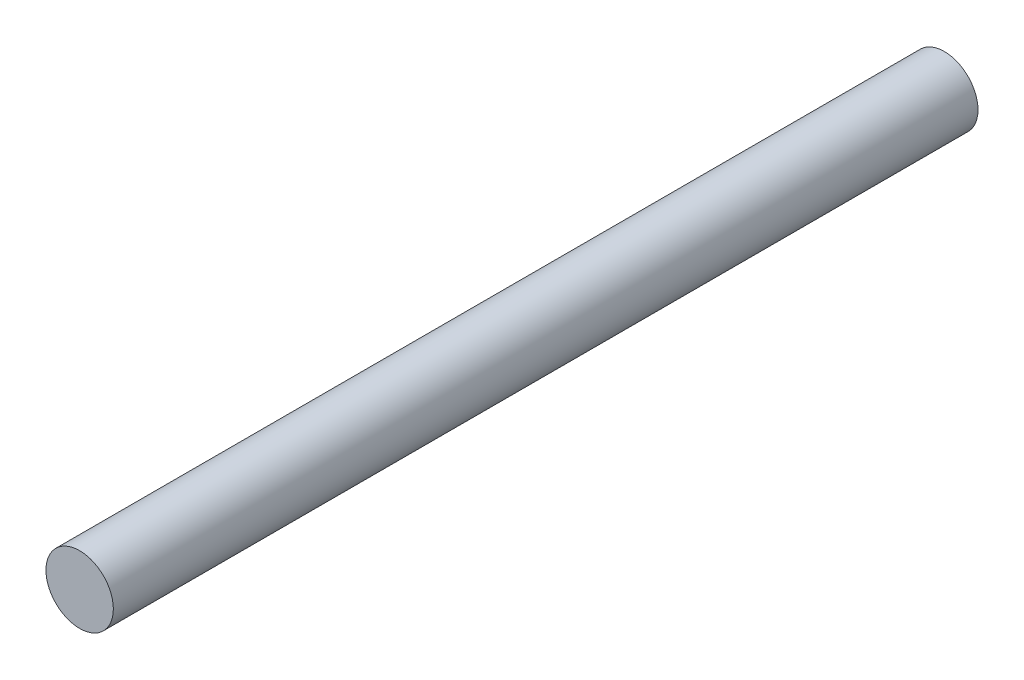
ISO-10303-21;
HEADER;
FILE_DESCRIPTION(('STEP AP214'),'2;1');
FILE_NAME('part.step','',(''),(''),'','','');
FILE_SCHEMA(('AUTOMOTIVE_DESIGN { 1 0 10303 214 1 1 1 1 }'));
ENDSEC;
DATA;
#1=APPLICATION_CONTEXT('core data for automotive mechanical design processes');
#2=APPLICATION_PROTOCOL_DEFINITION('international standard','automotive_design',2000,#1);
#3=PRODUCT_CONTEXT('',#1,'mechanical');
#4=PRODUCT('Part','Part','',(#3));
#5=PRODUCT_RELATED_PRODUCT_CATEGORY('part','',(#4));
#6=PRODUCT_DEFINITION_FORMATION('','',#4);
#7=PRODUCT_DEFINITION_CONTEXT('part definition',#1,'design');
#8=PRODUCT_DEFINITION('design','',#6,#7);
#9=PRODUCT_DEFINITION_SHAPE('','',#8);
#10=(LENGTH_UNIT() NAMED_UNIT(*) SI_UNIT(.MILLI.,.METRE.));
#11=(NAMED_UNIT(*) PLANE_ANGLE_UNIT() SI_UNIT($,.RADIAN.));
#12=(NAMED_UNIT(*) SI_UNIT($,.STERADIAN.) SOLID_ANGLE_UNIT());
#13=UNCERTAINTY_MEASURE_WITH_UNIT(LENGTH_MEASURE(1.E-05),#10,'distance_accuracy_value','');
#14=(GEOMETRIC_REPRESENTATION_CONTEXT(3) GLOBAL_UNCERTAINTY_ASSIGNED_CONTEXT((#13)) GLOBAL_UNIT_ASSIGNED_CONTEXT((#10,
#11,#12)) REPRESENTATION_CONTEXT('',''));
#15=CARTESIAN_POINT('',(0.,0.,0.));
#16=DIRECTION('',(0.,0.,1.));
#17=DIRECTION('',(1.,0.,0.));
#18=AXIS2_PLACEMENT_3D('',#15,#16,#17);
#19=CARTESIAN_POINT('',(0.,0.,-19.304));
#20=DIRECTION('',(0.,0.,1.));
#21=DIRECTION('',(1.,0.,0.));
#22=AXIS2_PLACEMENT_3D('',#19,#20,#21);
#23=CYLINDRICAL_SURFACE('',#22,2.);
#24=CARTESIAN_POINT('',(0.,0.,-19.304));
#25=DIRECTION('',(0.,0.,1.));
#26=DIRECTION('',(1.,0.,0.));
#27=AXIS2_PLACEMENT_3D('',#24,#25,#26);
#28=CIRCLE('',#27,2.);
#29=CARTESIAN_POINT('',(2.,0.,-19.304));
#30=VERTEX_POINT('',#29);
#31=EDGE_CURVE('E10',#30,#30,#28,.T.);
#32=ORIENTED_EDGE('',*,*,#31,.T.);
#33=EDGE_LOOP('',(#32));
#34=FACE_BOUND('',#33,.T.);
#35=CARTESIAN_POINT('',(0.,0.,32.004));
#36=DIRECTION('',(0.,0.,1.));
#37=DIRECTION('',(1.,0.,0.));
#38=AXIS2_PLACEMENT_3D('',#35,#36,#37);
#39=CIRCLE('',#38,2.);
#40=CARTESIAN_POINT('',(2.,0.,32.004));
#41=VERTEX_POINT('',#40);
#42=EDGE_CURVE('E38',#41,#41,#39,.T.);
#43=ORIENTED_EDGE('',*,*,#42,.F.);
#44=EDGE_LOOP('',(#43));
#45=FACE_BOUND('',#44,.T.);
#46=ADVANCED_FACE('F32',(#34,#45),#23,.T.);
#47=CARTESIAN_POINT('',(0.,0.,-19.304));
#48=DIRECTION('',(0.,0.,1.));
#49=DIRECTION('',(1.,0.,0.));
#50=AXIS2_PLACEMENT_3D('',#47,#48,#49);
#51=PLANE('',#50);
#52=ORIENTED_EDGE('',*,*,#31,.F.);
#53=EDGE_LOOP('',(#52));
#54=FACE_BOUND('',#53,.T.);
#55=ADVANCED_FACE('F47',(#54),#51,.F.);
#56=CARTESIAN_POINT('',(0.,0.,32.004));
#57=DIRECTION('',(0.,0.,1.));
#58=DIRECTION('',(1.,0.,0.));
#59=AXIS2_PLACEMENT_3D('',#56,#57,#58);
#60=PLANE('',#59);
#61=ORIENTED_EDGE('',*,*,#42,.T.);
#62=EDGE_LOOP('',(#61));
#63=FACE_BOUND('',#62,.T.);
#64=ADVANCED_FACE('F44',(#63),#60,.T.);
#65=CLOSED_SHELL('',(#46,#55,#64));
#66=MANIFOLD_SOLID_BREP('B2',#65);
#67=ADVANCED_BREP_SHAPE_REPRESENTATION('',(#18,#66),#14);
#68=SHAPE_DEFINITION_REPRESENTATION(#9,#67);
ENDSEC;
END-ISO-10303-21;
